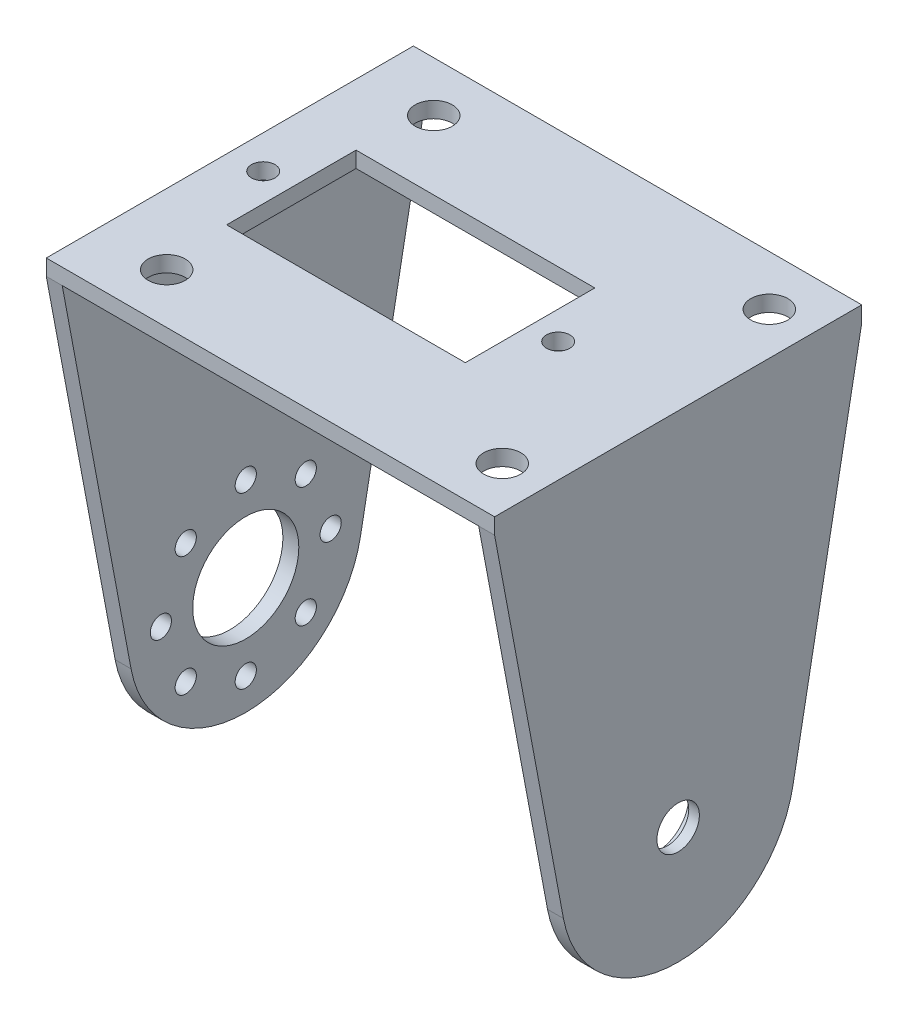
ISO-10303-21;
HEADER;
FILE_DESCRIPTION(('STEP AP214'),'2;1');
FILE_NAME('part.step','',(''),(''),'','','');
FILE_SCHEMA(('AUTOMOTIVE_DESIGN { 1 0 10303 214 1 1 1 1 }'));
ENDSEC;
DATA;
#1=APPLICATION_CONTEXT('core data for automotive mechanical design processes');
#2=APPLICATION_PROTOCOL_DEFINITION('international standard','automotive_design',2000,#1);
#3=PRODUCT_CONTEXT('',#1,'mechanical');
#4=PRODUCT('Part','Part','',(#3));
#5=PRODUCT_RELATED_PRODUCT_CATEGORY('part','',(#4));
#6=PRODUCT_DEFINITION_FORMATION('','',#4);
#7=PRODUCT_DEFINITION_CONTEXT('part definition',#1,'design');
#8=PRODUCT_DEFINITION('design','',#6,#7);
#9=PRODUCT_DEFINITION_SHAPE('','',#8);
#10=(LENGTH_UNIT() NAMED_UNIT(*) SI_UNIT(.MILLI.,.METRE.));
#11=(NAMED_UNIT(*) PLANE_ANGLE_UNIT() SI_UNIT($,.RADIAN.));
#12=(NAMED_UNIT(*) SI_UNIT($,.STERADIAN.) SOLID_ANGLE_UNIT());
#13=UNCERTAINTY_MEASURE_WITH_UNIT(LENGTH_MEASURE(1.E-05),#10,'distance_accuracy_value','');
#14=(GEOMETRIC_REPRESENTATION_CONTEXT(3) GLOBAL_UNCERTAINTY_ASSIGNED_CONTEXT((#13)) GLOBAL_UNIT_ASSIGNED_CONTEXT((#10,
#11,#12)) REPRESENTATION_CONTEXT('',''));
#15=CARTESIAN_POINT('',(0.,0.,0.));
#16=DIRECTION('',(0.,0.,1.));
#17=DIRECTION('',(1.,0.,0.));
#18=AXIS2_PLACEMENT_3D('',#15,#16,#17);
#19=CARTESIAN_POINT('',(42.25,0.,0.));
#20=DIRECTION('',(-1.,0.,0.));
#21=DIRECTION('',(0.,0.,1.));
#22=AXIS2_PLACEMENT_3D('',#19,#20,#21);
#23=CYLINDRICAL_SURFACE('',#22,3.);
#24=CARTESIAN_POINT('',(40.25,0.,0.));
#25=DIRECTION('',(1.,0.,0.));
#26=DIRECTION('',(0.,0.,-1.));
#27=AXIS2_PLACEMENT_3D('',#24,#25,#26);
#28=CIRCLE('',#27,3.);
#29=CARTESIAN_POINT('',(40.25,0.,-3.));
#30=VERTEX_POINT('',#29);
#31=EDGE_CURVE('E596',#30,#30,#28,.T.);
#32=ORIENTED_EDGE('',*,*,#31,.F.);
#33=EDGE_LOOP('',(#32));
#34=FACE_BOUND('',#33,.T.);
#35=CARTESIAN_POINT('',(41.25,0.,0.));
#36=DIRECTION('',(1.,0.,0.));
#37=DIRECTION('',(0.,0.,-1.));
#38=AXIS2_PLACEMENT_3D('',#35,#36,#37);
#39=CIRCLE('',#38,3.);
#40=CARTESIAN_POINT('',(41.25,0.,-3.));
#41=VERTEX_POINT('',#40);
#42=EDGE_CURVE('E590',#41,#41,#39,.T.);
#43=ORIENTED_EDGE('',*,*,#42,.T.);
#44=EDGE_LOOP('',(#43));
#45=FACE_BOUND('',#44,.T.);
#46=ADVANCED_FACE('F74',(#34,#45),#23,.F.);
#47=CARTESIAN_POINT('',(1.5,0.,0.));
#48=DIRECTION('',(1.,0.,0.));
#49=DIRECTION('',(0.,0.,-1.));
#50=AXIS2_PLACEMENT_3D('',#47,#48,#49);
#51=PLANE('',#50);
#52=CARTESIAN_POINT('',(1.5,5.65685424949245,5.65685424949231));
#53=DIRECTION('',(1.,0.,0.));
#54=DIRECTION('',(0.,0.,-1.));
#55=AXIS2_PLACEMENT_3D('',#52,#53,#54);
#56=CIRCLE('',#55,1.);
#57=CARTESIAN_POINT('',(1.5,5.65685424949245,4.65685424949231));
#58=VERTEX_POINT('',#57);
#59=EDGE_CURVE('E289',#58,#58,#56,.T.);
#60=ORIENTED_EDGE('',*,*,#59,.F.);
#61=EDGE_LOOP('',(#60));
#62=FACE_BOUND('',#61,.T.);
#63=CARTESIAN_POINT('',(1.5,0.,8.));
#64=DIRECTION('',(1.,0.,0.));
#65=DIRECTION('',(0.,0.,-1.));
#66=AXIS2_PLACEMENT_3D('',#63,#64,#65);
#67=CIRCLE('',#66,1.00000000000008);
#68=CARTESIAN_POINT('',(1.5,0.,6.99999999999992));
#69=VERTEX_POINT('',#68);
#70=EDGE_CURVE('E293',#69,#69,#67,.T.);
#71=ORIENTED_EDGE('',*,*,#70,.F.);
#72=EDGE_LOOP('',(#71));
#73=FACE_BOUND('',#72,.T.);
#74=CARTESIAN_POINT('',(1.5,-5.65685424949233,5.65685424949243));
#75=DIRECTION('',(1.,0.,0.));
#76=DIRECTION('',(0.,0.,-1.));
#77=AXIS2_PLACEMENT_3D('',#74,#75,#76);
#78=CIRCLE('',#77,1.);
#79=CARTESIAN_POINT('',(1.5,-5.65685424949233,4.65685424949243));
#80=VERTEX_POINT('',#79);
#81=EDGE_CURVE('E297',#80,#80,#78,.T.);
#82=ORIENTED_EDGE('',*,*,#81,.F.);
#83=EDGE_LOOP('',(#82));
#84=FACE_BOUND('',#83,.T.);
#85=CARTESIAN_POINT('',(1.5,-8.,0.));
#86=DIRECTION('',(1.,0.,0.));
#87=DIRECTION('',(0.,0.,-1.));
#88=AXIS2_PLACEMENT_3D('',#85,#86,#87);
#89=CIRCLE('',#88,1.);
#90=CARTESIAN_POINT('',(1.5,-8.,-0.999999999999944));
#91=VERTEX_POINT('',#90);
#92=EDGE_CURVE('E301',#91,#91,#89,.T.);
#93=ORIENTED_EDGE('',*,*,#92,.F.);
#94=EDGE_LOOP('',(#93));
#95=FACE_BOUND('',#94,.T.);
#96=CARTESIAN_POINT('',(1.5,-5.65685424949241,-5.65685424949235));
#97=DIRECTION('',(1.,0.,0.));
#98=DIRECTION('',(0.,0.,-1.));
#99=AXIS2_PLACEMENT_3D('',#96,#97,#98);
#100=CIRCLE('',#99,1.);
#101=CARTESIAN_POINT('',(1.5,-5.65685424949241,-6.65685424949235));
#102=VERTEX_POINT('',#101);
#103=EDGE_CURVE('E305',#102,#102,#100,.T.);
#104=ORIENTED_EDGE('',*,*,#103,.F.);
#105=EDGE_LOOP('',(#104));
#106=FACE_BOUND('',#105,.T.);
#107=CARTESIAN_POINT('',(1.5,0.,-8.));
#108=DIRECTION('',(1.,0.,0.));
#109=DIRECTION('',(0.,0.,-1.));
#110=AXIS2_PLACEMENT_3D('',#107,#108,#109);
#111=CIRCLE('',#110,1.);
#112=CARTESIAN_POINT('',(1.5,0.,-9.));
#113=VERTEX_POINT('',#112);
#114=EDGE_CURVE('E309',#113,#113,#111,.T.);
#115=ORIENTED_EDGE('',*,*,#114,.F.);
#116=EDGE_LOOP('',(#115));
#117=FACE_BOUND('',#116,.T.);
#118=CARTESIAN_POINT('',(1.5,5.65685424949237,-5.65685424949239));
#119=DIRECTION('',(1.,0.,0.));
#120=DIRECTION('',(0.,0.,-1.));
#121=AXIS2_PLACEMENT_3D('',#118,#119,#120);
#122=CIRCLE('',#121,1.);
#123=CARTESIAN_POINT('',(1.5,5.65685424949237,-6.65685424949239));
#124=VERTEX_POINT('',#123);
#125=EDGE_CURVE('E313',#124,#124,#122,.T.);
#126=ORIENTED_EDGE('',*,*,#125,.F.);
#127=EDGE_LOOP('',(#126));
#128=FACE_BOUND('',#127,.T.);
#129=CARTESIAN_POINT('',(1.5,8.,0.));
#130=DIRECTION('',(1.,0.,0.));
#131=DIRECTION('',(0.,0.,-1.));
#132=AXIS2_PLACEMENT_3D('',#129,#130,#131);
#133=CIRCLE('',#132,1.);
#134=CARTESIAN_POINT('',(1.5,8.,-1.));
#135=VERTEX_POINT('',#134);
#136=EDGE_CURVE('E317',#135,#135,#133,.T.);
#137=ORIENTED_EDGE('',*,*,#136,.F.);
#138=EDGE_LOOP('',(#137));
#139=FACE_BOUND('',#138,.T.);
#140=CARTESIAN_POINT('',(1.5,0.,0.));
#141=DIRECTION('',(1.,0.,0.));
#142=DIRECTION('',(0.,0.,-1.));
#143=AXIS2_PLACEMENT_3D('',#140,#141,#142);
#144=CIRCLE('',#143,5.);
#145=CARTESIAN_POINT('',(1.5,0.,-5.));
#146=VERTEX_POINT('',#145);
#147=EDGE_CURVE('E321',#146,#146,#144,.T.);
#148=ORIENTED_EDGE('',*,*,#147,.F.);
#149=EDGE_LOOP('',(#148));
#150=FACE_BOUND('',#149,.T.);
#151=DIRECTION('',(0.,-0.982797037035179,0.184688884329495));
#152=VECTOR('',#151,1.);
#153=CARTESIAN_POINT('',(1.5,-2.03157772762444,-10.810767407387));
#154=LINE('',#153,#152);
#155=CARTESIAN_POINT('',(1.5,32.5,-17.3));
#156=VERTEX_POINT('',#155);
#157=CARTESIAN_POINT('',(1.5,-2.03157772762444,-10.810767407387));
#158=VERTEX_POINT('',#157);
#159=EDGE_CURVE('E285',#156,#158,#154,.T.);
#160=ORIENTED_EDGE('',*,*,#159,.F.);
#161=DIRECTION('',(0.,0.,1.));
#162=VECTOR('',#161,1.);
#163=CARTESIAN_POINT('',(1.5,32.5,0.));
#164=LINE('',#163,#162);
#165=CARTESIAN_POINT('',(1.5,32.5,17.3));
#166=VERTEX_POINT('',#165);
#167=EDGE_CURVE('E272',#156,#166,#164,.T.);
#168=ORIENTED_EDGE('',*,*,#167,.T.);
#169=DIRECTION('',(0.,-0.982797037035179,-0.184688884329495));
#170=VECTOR('',#169,1.);
#171=CARTESIAN_POINT('',(1.5,-2.03157772762445,10.810767407387));
#172=LINE('',#171,#170);
#173=CARTESIAN_POINT('',(1.5,-2.03157772762445,10.810767407387));
#174=VERTEX_POINT('',#173);
#175=EDGE_CURVE('E277',#166,#174,#172,.T.);
#176=ORIENTED_EDGE('',*,*,#175,.T.);
#177=CARTESIAN_POINT('',(1.5,0.,0.));
#178=DIRECTION('',(1.,0.,0.));
#179=DIRECTION('',(0.,0.,-1.));
#180=AXIS2_PLACEMENT_3D('',#177,#178,#179);
#181=CIRCLE('',#180,11.);
#182=EDGE_CURVE('E281',#174,#158,#181,.T.);
#183=ORIENTED_EDGE('',*,*,#182,.T.);
#184=EDGE_LOOP('',(#160,#168,#176,#183));
#185=FACE_BOUND('',#184,.T.);
#186=ADVANCED_FACE('F455',(#62,#73,#84,#95,#106,#117,#128,#139,#150,#185),#51,.T.);
#187=CARTESIAN_POINT('',(1.5,-2.03157772762445,10.810767407387));
#188=DIRECTION('',(0.,0.184688884329495,-0.982797037035179));
#189=DIRECTION('',(0.,0.982797037035179,0.184688884329495));
#190=AXIS2_PLACEMENT_3D('',#187,#188,#189);
#191=PLANE('',#190);
#192=DIRECTION('',(0.,-0.982797037035179,-0.184688884329495));
#193=VECTOR('',#192,1.);
#194=CARTESIAN_POINT('',(0.,-2.03157772762445,10.810767407387));
#195=LINE('',#194,#193);
#196=CARTESIAN_POINT('',(0.,32.5,17.3));
#197=VERTEX_POINT('',#196);
#198=CARTESIAN_POINT('',(0.,-2.03157772762445,10.810767407387));
#199=VERTEX_POINT('',#198);
#200=EDGE_CURVE('E276',#197,#199,#195,.T.);
#201=ORIENTED_EDGE('',*,*,#200,.T.);
#202=DIRECTION('',(-1.,0.,0.));
#203=VECTOR('',#202,1.);
#204=CARTESIAN_POINT('',(1.5,-2.03157772762445,10.810767407387));
#205=LINE('',#204,#203);
#206=EDGE_CURVE('E398',#174,#199,#205,.T.);
#207=ORIENTED_EDGE('',*,*,#206,.F.);
#208=ORIENTED_EDGE('',*,*,#175,.F.);
#209=DIRECTION('',(-1.,0.,0.));
#210=VECTOR('',#209,1.);
#211=CARTESIAN_POINT('',(1.5,32.5,17.3));
#212=LINE('',#211,#210);
#213=EDGE_CURVE('E325',#166,#197,#212,.T.);
#214=ORIENTED_EDGE('',*,*,#213,.T.);
#215=EDGE_LOOP('',(#201,#207,#208,#214));
#216=FACE_BOUND('',#215,.T.);
#217=ADVANCED_FACE('F76',(#216),#191,.F.);
#218=CARTESIAN_POINT('',(1.5,0.,0.));
#219=DIRECTION('',(-1.,0.,0.));
#220=DIRECTION('',(0.,0.,1.));
#221=AXIS2_PLACEMENT_3D('',#218,#219,#220);
#222=CYLINDRICAL_SURFACE('',#221,11.);
#223=CARTESIAN_POINT('',(0.,0.,0.));
#224=DIRECTION('',(1.,0.,0.));
#225=DIRECTION('',(0.,0.,-1.));
#226=AXIS2_PLACEMENT_3D('',#223,#224,#225);
#227=CIRCLE('',#226,11.);
#228=CARTESIAN_POINT('',(0.,-2.03157772762444,-10.810767407387));
#229=VERTEX_POINT('',#228);
#230=EDGE_CURVE('E329',#199,#229,#227,.T.);
#231=ORIENTED_EDGE('',*,*,#230,.T.);
#232=DIRECTION('',(-1.,0.,0.));
#233=VECTOR('',#232,1.);
#234=CARTESIAN_POINT('',(1.5,-2.03157772762444,-10.810767407387));
#235=LINE('',#234,#233);
#236=EDGE_CURVE('E395',#158,#229,#235,.T.);
#237=ORIENTED_EDGE('',*,*,#236,.F.);
#238=ORIENTED_EDGE('',*,*,#182,.F.);
#239=ORIENTED_EDGE('',*,*,#206,.T.);
#240=EDGE_LOOP('',(#231,#237,#238,#239));
#241=FACE_BOUND('',#240,.T.);
#242=ADVANCED_FACE('F544',(#241),#222,.T.);
#243=CARTESIAN_POINT('',(1.5,-2.03157772762444,-10.810767407387));
#244=DIRECTION('',(0.,-0.184688884329495,-0.982797037035179));
#245=DIRECTION('',(0.,0.982797037035179,-0.184688884329495));
#246=AXIS2_PLACEMENT_3D('',#243,#244,#245);
#247=PLANE('',#246);
#248=DIRECTION('',(0.,-0.982797037035179,0.184688884329495));
#249=VECTOR('',#248,1.);
#250=CARTESIAN_POINT('',(0.,-2.03157772762444,-10.810767407387));
#251=LINE('',#250,#249);
#252=CARTESIAN_POINT('',(0.,32.5,-17.3));
#253=VERTEX_POINT('',#252);
#254=EDGE_CURVE('E333',#253,#229,#251,.T.);
#255=ORIENTED_EDGE('',*,*,#254,.F.);
#256=DIRECTION('',(-1.,0.,0.));
#257=VECTOR('',#256,1.);
#258=CARTESIAN_POINT('',(1.5,32.5,-17.3));
#259=LINE('',#258,#257);
#260=EDGE_CURVE('E392',#156,#253,#259,.T.);
#261=ORIENTED_EDGE('',*,*,#260,.F.);
#262=ORIENTED_EDGE('',*,*,#159,.T.);
#263=ORIENTED_EDGE('',*,*,#236,.T.);
#264=EDGE_LOOP('',(#255,#261,#262,#263));
#265=FACE_BOUND('',#264,.T.);
#266=ADVANCED_FACE('F541',(#265),#247,.T.);
#267=CARTESIAN_POINT('',(1.5,0.,-17.3));
#268=DIRECTION('',(0.,0.,1.));
#269=DIRECTION('',(1.,0.,0.));
#270=AXIS2_PLACEMENT_3D('',#267,#268,#269);
#271=PLANE('',#270);
#272=DIRECTION('',(0.,1.,0.));
#273=VECTOR('',#272,1.);
#274=CARTESIAN_POINT('',(0.,0.,-17.3));
#275=LINE('',#274,#273);
#276=CARTESIAN_POINT('',(0.,34.,-17.3));
#277=VERTEX_POINT('',#276);
#278=EDGE_CURVE('E337',#253,#277,#275,.T.);
#279=ORIENTED_EDGE('',*,*,#278,.T.);
#280=DIRECTION('',(-1.,0.,0.));
#281=VECTOR('',#280,1.);
#282=CARTESIAN_POINT('',(1.5,34.,-17.3));
#283=LINE('',#282,#281);
#284=CARTESIAN_POINT('',(42.25,34.,-17.3));
#285=VERTEX_POINT('',#284);
#286=EDGE_CURVE('E389',#285,#277,#283,.T.);
#287=ORIENTED_EDGE('',*,*,#286,.F.);
#288=DIRECTION('',(0.,-1.,0.));
#289=VECTOR('',#288,1.);
#290=CARTESIAN_POINT('',(42.25,0.,-17.3));
#291=LINE('',#290,#289);
#292=CARTESIAN_POINT('',(42.25,32.5,-17.3));
#293=VERTEX_POINT('',#292);
#294=EDGE_CURVE('E232',#285,#293,#291,.T.);
#295=ORIENTED_EDGE('',*,*,#294,.T.);
#296=DIRECTION('',(-1.,0.,0.));
#297=VECTOR('',#296,1.);
#298=CARTESIAN_POINT('',(42.25,32.5,-17.3));
#299=LINE('',#298,#297);
#300=CARTESIAN_POINT('',(40.75,32.5,-17.3));
#301=VERTEX_POINT('',#300);
#302=EDGE_CURVE('E236',#293,#301,#299,.T.);
#303=ORIENTED_EDGE('',*,*,#302,.T.);
#304=DIRECTION('',(-1.,0.,0.));
#305=VECTOR('',#304,1.);
#306=CARTESIAN_POINT('',(40.75,32.5,-17.3));
#307=LINE('',#306,#305);
#308=EDGE_CURVE('E268',#301,#156,#307,.T.);
#309=ORIENTED_EDGE('',*,*,#308,.T.);
#310=ORIENTED_EDGE('',*,*,#260,.T.);
#311=EDGE_LOOP('',(#279,#287,#295,#303,#309,#310));
#312=FACE_BOUND('',#311,.T.);
#313=ADVANCED_FACE('F537',(#312),#271,.F.);
#314=CARTESIAN_POINT('',(1.5,34.,0.));
#315=DIRECTION('',(0.,1.,0.));
#316=DIRECTION('',(0.,0.,1.));
#317=AXIS2_PLACEMENT_3D('',#314,#315,#316);
#318=PLANE('',#317);
#319=CARTESIAN_POINT('',(6.63,34.,12.583801515));
#320=DIRECTION('',(0.,1.,0.));
#321=DIRECTION('',(0.,0.,1.));
#322=AXIS2_PLACEMENT_3D('',#319,#320,#321);
#323=CIRCLE('',#322,1.75);
#324=CARTESIAN_POINT('',(6.63,34.,14.333801515));
#325=VERTEX_POINT('',#324);
#326=EDGE_CURVE('E605',#325,#325,#323,.T.);
#327=ORIENTED_EDGE('',*,*,#326,.F.);
#328=EDGE_LOOP('',(#327));
#329=FACE_BOUND('',#328,.T.);
#330=CARTESIAN_POINT('',(38.257478,34.,12.583801515));
#331=DIRECTION('',(0.,1.,0.));
#332=DIRECTION('',(0.,0.,1.));
#333=AXIS2_PLACEMENT_3D('',#330,#331,#332);
#334=CIRCLE('',#333,1.75);
#335=CARTESIAN_POINT('',(38.257478,34.,14.333801515));
#336=VERTEX_POINT('',#335);
#337=EDGE_CURVE('E625',#336,#336,#334,.T.);
#338=ORIENTED_EDGE('',*,*,#337,.F.);
#339=EDGE_LOOP('',(#338));
#340=FACE_BOUND('',#339,.T.);
#341=CARTESIAN_POINT('',(38.257478,34.,-12.583801515));
#342=DIRECTION('',(0.,1.,0.));
#343=DIRECTION('',(0.,0.,1.));
#344=AXIS2_PLACEMENT_3D('',#341,#342,#343);
#345=CIRCLE('',#344,1.75);
#346=CARTESIAN_POINT('',(38.257478,34.,-10.833801515));
#347=VERTEX_POINT('',#346);
#348=EDGE_CURVE('E621',#347,#347,#345,.T.);
#349=ORIENTED_EDGE('',*,*,#348,.F.);
#350=EDGE_LOOP('',(#349));
#351=FACE_BOUND('',#350,.T.);
#352=CARTESIAN_POINT('',(6.63,34.,-12.583801515));
#353=DIRECTION('',(0.,1.,0.));
#354=DIRECTION('',(0.,0.,1.));
#355=AXIS2_PLACEMENT_3D('',#352,#353,#354);
#356=CIRCLE('',#355,1.75);
#357=CARTESIAN_POINT('',(6.63,34.,-10.833801515));
#358=VERTEX_POINT('',#357);
#359=EDGE_CURVE('E617',#358,#358,#356,.T.);
#360=ORIENTED_EDGE('',*,*,#359,.F.);
#361=EDGE_LOOP('',(#360));
#362=FACE_BOUND('',#361,.T.);
#363=CARTESIAN_POINT('',(3.145,34.,0.));
#364=DIRECTION('',(0.,1.,0.));
#365=DIRECTION('',(0.,0.,1.));
#366=AXIS2_PLACEMENT_3D('',#363,#364,#365);
#367=CIRCLE('',#366,1.1);
#368=CARTESIAN_POINT('',(3.145,34.,1.1));
#369=VERTEX_POINT('',#368);
#370=EDGE_CURVE('E613',#369,#369,#367,.T.);
#371=ORIENTED_EDGE('',*,*,#370,.F.);
#372=EDGE_LOOP('',(#371));
#373=FACE_BOUND('',#372,.T.);
#374=CARTESIAN_POINT('',(30.945,34.,0.));
#375=DIRECTION('',(0.,1.,0.));
#376=DIRECTION('',(0.,0.,1.));
#377=AXIS2_PLACEMENT_3D('',#374,#375,#376);
#378=CIRCLE('',#377,1.10000000000001);
#379=CARTESIAN_POINT('',(30.945,34.,1.10000000000001));
#380=VERTEX_POINT('',#379);
#381=EDGE_CURVE('E609',#380,#380,#378,.T.);
#382=ORIENTED_EDGE('',*,*,#381,.F.);
#383=EDGE_LOOP('',(#382));
#384=FACE_BOUND('',#383,.T.);
#385=DIRECTION('',(0.,0.,-1.));
#386=VECTOR('',#385,1.);
#387=CARTESIAN_POINT('',(28.295,34.,6.1));
#388=LINE('',#387,#386);
#389=CARTESIAN_POINT('',(28.295,34.,6.1));
#390=VERTEX_POINT('',#389);
#391=CARTESIAN_POINT('',(28.295,34.,-6.1));
#392=VERTEX_POINT('',#391);
#393=EDGE_CURVE('E92',#390,#392,#388,.T.);
#394=ORIENTED_EDGE('',*,*,#393,.F.);
#395=DIRECTION('',(1.,0.,0.));
#396=VECTOR('',#395,1.);
#397=CARTESIAN_POINT('',(5.795,34.,6.1));
#398=LINE('',#397,#396);
#399=CARTESIAN_POINT('',(5.795,34.,6.1));
#400=VERTEX_POINT('',#399);
#401=EDGE_CURVE('E199',#400,#390,#398,.T.);
#402=ORIENTED_EDGE('',*,*,#401,.F.);
#403=DIRECTION('',(0.,0.,1.));
#404=VECTOR('',#403,1.);
#405=CARTESIAN_POINT('',(5.795,34.,6.1));
#406=LINE('',#405,#404);
#407=CARTESIAN_POINT('',(5.795,34.,-6.1));
#408=VERTEX_POINT('',#407);
#409=EDGE_CURVE('E181',#408,#400,#406,.T.);
#410=ORIENTED_EDGE('',*,*,#409,.F.);
#411=DIRECTION('',(-1.,0.,0.));
#412=VECTOR('',#411,1.);
#413=CARTESIAN_POINT('',(5.795,34.,-6.1));
#414=LINE('',#413,#412);
#415=EDGE_CURVE('E191',#392,#408,#414,.T.);
#416=ORIENTED_EDGE('',*,*,#415,.F.);
#417=EDGE_LOOP('',(#394,#402,#410,#416));
#418=FACE_BOUND('',#417,.T.);
#419=DIRECTION('',(0.,0.,-1.));
#420=VECTOR('',#419,1.);
#421=CARTESIAN_POINT('',(0.,34.,0.));
#422=LINE('',#421,#420);
#423=CARTESIAN_POINT('',(0.,34.,17.3));
#424=VERTEX_POINT('',#423);
#425=EDGE_CURVE('E341',#424,#277,#422,.T.);
#426=ORIENTED_EDGE('',*,*,#425,.F.);
#427=DIRECTION('',(-1.,0.,0.));
#428=VECTOR('',#427,1.);
#429=CARTESIAN_POINT('',(1.5,34.,17.3));
#430=LINE('',#429,#428);
#431=CARTESIAN_POINT('',(42.25,34.,17.3));
#432=VERTEX_POINT('',#431);
#433=EDGE_CURVE('E386',#432,#424,#430,.T.);
#434=ORIENTED_EDGE('',*,*,#433,.F.);
#435=DIRECTION('',(0.,0.,1.));
#436=VECTOR('',#435,1.);
#437=CARTESIAN_POINT('',(42.25,34.,0.));
#438=LINE('',#437,#436);
#439=EDGE_CURVE('E214',#285,#432,#438,.T.);
#440=ORIENTED_EDGE('',*,*,#439,.F.);
#441=ORIENTED_EDGE('',*,*,#286,.T.);
#442=EDGE_LOOP('',(#426,#434,#440,#441));
#443=FACE_BOUND('',#442,.T.);
#444=ADVANCED_FACE('F196',(#329,#340,#351,#362,#373,#384,#418,#443),#318,.T.);
#445=CARTESIAN_POINT('',(1.5,8.,0.));
#446=DIRECTION('',(-1.,0.,0.));
#447=DIRECTION('',(0.,0.,1.));
#448=AXIS2_PLACEMENT_3D('',#445,#446,#447);
#449=CYLINDRICAL_SURFACE('',#448,1.);
#450=ORIENTED_EDGE('',*,*,#136,.T.);
#451=EDGE_LOOP('',(#450));
#452=FACE_BOUND('',#451,.T.);
#453=CARTESIAN_POINT('',(0.,8.,0.));
#454=DIRECTION('',(1.,0.,0.));
#455=DIRECTION('',(0.,0.,-1.));
#456=AXIS2_PLACEMENT_3D('',#453,#454,#455);
#457=CIRCLE('',#456,1.);
#458=CARTESIAN_POINT('',(0.,8.,-1.));
#459=VERTEX_POINT('',#458);
#460=EDGE_CURVE('E377',#459,#459,#457,.T.);
#461=ORIENTED_EDGE('',*,*,#460,.F.);
#462=EDGE_LOOP('',(#461));
#463=FACE_BOUND('',#462,.T.);
#464=ADVANCED_FACE('F500',(#452,#463),#449,.F.);
#465=CARTESIAN_POINT('',(1.5,5.65685424949237,-5.65685424949239));
#466=DIRECTION('',(-1.,0.,0.));
#467=DIRECTION('',(0.,0.,1.));
#468=AXIS2_PLACEMENT_3D('',#465,#466,#467);
#469=CYLINDRICAL_SURFACE('',#468,1.);
#470=ORIENTED_EDGE('',*,*,#125,.T.);
#471=EDGE_LOOP('',(#470));
#472=FACE_BOUND('',#471,.T.);
#473=CARTESIAN_POINT('',(0.,5.65685424949237,-5.65685424949239));
#474=DIRECTION('',(1.,0.,0.));
#475=DIRECTION('',(0.,0.,-1.));
#476=AXIS2_PLACEMENT_3D('',#473,#474,#475);
#477=CIRCLE('',#476,1.);
#478=CARTESIAN_POINT('',(0.,5.65685424949237,-6.65685424949239));
#479=VERTEX_POINT('',#478);
#480=EDGE_CURVE('E373',#479,#479,#477,.T.);
#481=ORIENTED_EDGE('',*,*,#480,.F.);
#482=EDGE_LOOP('',(#481));
#483=FACE_BOUND('',#482,.T.);
#484=ADVANCED_FACE('F503',(#472,#483),#469,.F.);
#485=CARTESIAN_POINT('',(1.5,0.,-8.));
#486=DIRECTION('',(-1.,0.,0.));
#487=DIRECTION('',(0.,0.,1.));
#488=AXIS2_PLACEMENT_3D('',#485,#486,#487);
#489=CYLINDRICAL_SURFACE('',#488,1.);
#490=ORIENTED_EDGE('',*,*,#114,.T.);
#491=EDGE_LOOP('',(#490));
#492=FACE_BOUND('',#491,.T.);
#493=CARTESIAN_POINT('',(0.,0.,-8.));
#494=DIRECTION('',(1.,0.,0.));
#495=DIRECTION('',(0.,0.,-1.));
#496=AXIS2_PLACEMENT_3D('',#493,#494,#495);
#497=CIRCLE('',#496,1.);
#498=CARTESIAN_POINT('',(0.,0.,-9.));
#499=VERTEX_POINT('',#498);
#500=EDGE_CURVE('E369',#499,#499,#497,.T.);
#501=ORIENTED_EDGE('',*,*,#500,.F.);
#502=EDGE_LOOP('',(#501));
#503=FACE_BOUND('',#502,.T.);
#504=ADVANCED_FACE('F507',(#492,#503),#489,.F.);
#505=CARTESIAN_POINT('',(1.5,-5.65685424949241,-5.65685424949235));
#506=DIRECTION('',(-1.,0.,0.));
#507=DIRECTION('',(0.,0.,1.));
#508=AXIS2_PLACEMENT_3D('',#505,#506,#507);
#509=CYLINDRICAL_SURFACE('',#508,1.);
#510=ORIENTED_EDGE('',*,*,#103,.T.);
#511=EDGE_LOOP('',(#510));
#512=FACE_BOUND('',#511,.T.);
#513=CARTESIAN_POINT('',(0.,-5.65685424949241,-5.65685424949235));
#514=DIRECTION('',(1.,0.,0.));
#515=DIRECTION('',(0.,0.,-1.));
#516=AXIS2_PLACEMENT_3D('',#513,#514,#515);
#517=CIRCLE('',#516,1.);
#518=CARTESIAN_POINT('',(0.,-5.65685424949241,-6.65685424949235));
#519=VERTEX_POINT('',#518);
#520=EDGE_CURVE('E365',#519,#519,#517,.T.);
#521=ORIENTED_EDGE('',*,*,#520,.F.);
#522=EDGE_LOOP('',(#521));
#523=FACE_BOUND('',#522,.T.);
#524=ADVANCED_FACE('F511',(#512,#523),#509,.F.);
#525=CARTESIAN_POINT('',(1.5,-8.,0.));
#526=DIRECTION('',(-1.,0.,0.));
#527=DIRECTION('',(0.,0.,1.));
#528=AXIS2_PLACEMENT_3D('',#525,#526,#527);
#529=CYLINDRICAL_SURFACE('',#528,1.);
#530=ORIENTED_EDGE('',*,*,#92,.T.);
#531=EDGE_LOOP('',(#530));
#532=FACE_BOUND('',#531,.T.);
#533=CARTESIAN_POINT('',(0.,-8.,0.));
#534=DIRECTION('',(1.,0.,0.));
#535=DIRECTION('',(0.,0.,-1.));
#536=AXIS2_PLACEMENT_3D('',#533,#534,#535);
#537=CIRCLE('',#536,1.);
#538=CARTESIAN_POINT('',(0.,-8.,-0.999999999999944));
#539=VERTEX_POINT('',#538);
#540=EDGE_CURVE('E361',#539,#539,#537,.T.);
#541=ORIENTED_EDGE('',*,*,#540,.F.);
#542=EDGE_LOOP('',(#541));
#543=FACE_BOUND('',#542,.T.);
#544=ADVANCED_FACE('F515',(#532,#543),#529,.F.);
#545=CARTESIAN_POINT('',(1.5,-5.65685424949233,5.65685424949243));
#546=DIRECTION('',(-1.,0.,0.));
#547=DIRECTION('',(0.,0.,1.));
#548=AXIS2_PLACEMENT_3D('',#545,#546,#547);
#549=CYLINDRICAL_SURFACE('',#548,1.);
#550=ORIENTED_EDGE('',*,*,#81,.T.);
#551=EDGE_LOOP('',(#550));
#552=FACE_BOUND('',#551,.T.);
#553=CARTESIAN_POINT('',(0.,-5.65685424949233,5.65685424949243));
#554=DIRECTION('',(1.,0.,0.));
#555=DIRECTION('',(0.,0.,-1.));
#556=AXIS2_PLACEMENT_3D('',#553,#554,#555);
#557=CIRCLE('',#556,1.);
#558=CARTESIAN_POINT('',(0.,-5.65685424949233,4.65685424949243));
#559=VERTEX_POINT('',#558);
#560=EDGE_CURVE('E357',#559,#559,#557,.T.);
#561=ORIENTED_EDGE('',*,*,#560,.F.);
#562=EDGE_LOOP('',(#561));
#563=FACE_BOUND('',#562,.T.);
#564=ADVANCED_FACE('F519',(#552,#563),#549,.F.);
#565=CARTESIAN_POINT('',(1.5,0.,8.));
#566=DIRECTION('',(-1.,0.,0.));
#567=DIRECTION('',(0.,0.,1.));
#568=AXIS2_PLACEMENT_3D('',#565,#566,#567);
#569=CYLINDRICAL_SURFACE('',#568,1.00000000000008);
#570=ORIENTED_EDGE('',*,*,#70,.T.);
#571=EDGE_LOOP('',(#570));
#572=FACE_BOUND('',#571,.T.);
#573=CARTESIAN_POINT('',(0.,0.,8.));
#574=DIRECTION('',(1.,0.,0.));
#575=DIRECTION('',(0.,0.,-1.));
#576=AXIS2_PLACEMENT_3D('',#573,#574,#575);
#577=CIRCLE('',#576,1.00000000000008);
#578=CARTESIAN_POINT('',(0.,0.,6.99999999999992));
#579=VERTEX_POINT('',#578);
#580=EDGE_CURVE('E353',#579,#579,#577,.T.);
#581=ORIENTED_EDGE('',*,*,#580,.F.);
#582=EDGE_LOOP('',(#581));
#583=FACE_BOUND('',#582,.T.);
#584=ADVANCED_FACE('F523',(#572,#583),#569,.F.);
#585=CARTESIAN_POINT('',(1.5,5.65685424949245,5.65685424949231));
#586=DIRECTION('',(-1.,0.,0.));
#587=DIRECTION('',(0.,0.,1.));
#588=AXIS2_PLACEMENT_3D('',#585,#586,#587);
#589=CYLINDRICAL_SURFACE('',#588,1.);
#590=ORIENTED_EDGE('',*,*,#59,.T.);
#591=EDGE_LOOP('',(#590));
#592=FACE_BOUND('',#591,.T.);
#593=CARTESIAN_POINT('',(0.,5.65685424949245,5.65685424949231));
#594=DIRECTION('',(1.,0.,0.));
#595=DIRECTION('',(0.,0.,-1.));
#596=AXIS2_PLACEMENT_3D('',#593,#594,#595);
#597=CIRCLE('',#596,1.);
#598=CARTESIAN_POINT('',(0.,5.65685424949245,4.65685424949231));
#599=VERTEX_POINT('',#598);
#600=EDGE_CURVE('E349',#599,#599,#597,.T.);
#601=ORIENTED_EDGE('',*,*,#600,.F.);
#602=EDGE_LOOP('',(#601));
#603=FACE_BOUND('',#602,.T.);
#604=ADVANCED_FACE('F527',(#592,#603),#589,.F.);
#605=CARTESIAN_POINT('',(1.5,0.,17.3));
#606=DIRECTION('',(0.,0.,1.));
#607=DIRECTION('',(1.,0.,0.));
#608=AXIS2_PLACEMENT_3D('',#605,#606,#607);
#609=PLANE('',#608);
#610=DIRECTION('',(0.,1.,0.));
#611=VECTOR('',#610,1.);
#612=CARTESIAN_POINT('',(0.,0.,17.3));
#613=LINE('',#612,#611);
#614=EDGE_CURVE('E345',#197,#424,#613,.T.);
#615=ORIENTED_EDGE('',*,*,#614,.F.);
#616=ORIENTED_EDGE('',*,*,#213,.F.);
#617=DIRECTION('',(-1.,0.,0.));
#618=VECTOR('',#617,1.);
#619=CARTESIAN_POINT('',(40.75,32.5,17.3));
#620=LINE('',#619,#618);
#621=CARTESIAN_POINT('',(40.75,32.5,17.3));
#622=VERTEX_POINT('',#621);
#623=EDGE_CURVE('E265',#622,#166,#620,.T.);
#624=ORIENTED_EDGE('',*,*,#623,.F.);
#625=DIRECTION('',(-1.,0.,0.));
#626=VECTOR('',#625,1.);
#627=CARTESIAN_POINT('',(42.25,32.5,17.3));
#628=LINE('',#627,#626);
#629=CARTESIAN_POINT('',(42.25,32.5,17.3));
#630=VERTEX_POINT('',#629);
#631=EDGE_CURVE('E257',#630,#622,#628,.T.);
#632=ORIENTED_EDGE('',*,*,#631,.F.);
#633=DIRECTION('',(0.,-1.,0.));
#634=VECTOR('',#633,1.);
#635=CARTESIAN_POINT('',(42.25,0.,17.3));
#636=LINE('',#635,#634);
#637=EDGE_CURVE('E218',#432,#630,#636,.T.);
#638=ORIENTED_EDGE('',*,*,#637,.F.);
#639=ORIENTED_EDGE('',*,*,#433,.T.);
#640=EDGE_LOOP('',(#615,#616,#624,#632,#638,#639));
#641=FACE_BOUND('',#640,.T.);
#642=ADVANCED_FACE('F498',(#641),#609,.T.);
#643=CARTESIAN_POINT('',(1.5,0.,0.));
#644=DIRECTION('',(-1.,0.,0.));
#645=DIRECTION('',(0.,0.,1.));
#646=AXIS2_PLACEMENT_3D('',#643,#644,#645);
#647=CYLINDRICAL_SURFACE('',#646,5.);
#648=ORIENTED_EDGE('',*,*,#147,.T.);
#649=EDGE_LOOP('',(#648));
#650=FACE_BOUND('',#649,.T.);
#651=CARTESIAN_POINT('',(0.,0.,0.));
#652=DIRECTION('',(1.,0.,0.));
#653=DIRECTION('',(0.,0.,-1.));
#654=AXIS2_PLACEMENT_3D('',#651,#652,#653);
#655=CIRCLE('',#654,5.);
#656=CARTESIAN_POINT('',(0.,0.,-5.));
#657=VERTEX_POINT('',#656);
#658=EDGE_CURVE('E282',#657,#657,#655,.T.);
#659=ORIENTED_EDGE('',*,*,#658,.F.);
#660=EDGE_LOOP('',(#659));
#661=FACE_BOUND('',#660,.T.);
#662=ADVANCED_FACE('F494',(#650,#661),#647,.F.);
#663=CARTESIAN_POINT('',(0.,0.,0.));
#664=DIRECTION('',(1.,0.,0.));
#665=DIRECTION('',(0.,0.,-1.));
#666=AXIS2_PLACEMENT_3D('',#663,#664,#665);
#667=PLANE('',#666);
#668=ORIENTED_EDGE('',*,*,#278,.F.);
#669=ORIENTED_EDGE('',*,*,#254,.T.);
#670=ORIENTED_EDGE('',*,*,#230,.F.);
#671=ORIENTED_EDGE('',*,*,#200,.F.);
#672=ORIENTED_EDGE('',*,*,#614,.T.);
#673=ORIENTED_EDGE('',*,*,#425,.T.);
#674=EDGE_LOOP('',(#668,#669,#670,#671,#672,#673));
#675=FACE_BOUND('',#674,.T.);
#676=ORIENTED_EDGE('',*,*,#658,.T.);
#677=EDGE_LOOP('',(#676));
#678=FACE_BOUND('',#677,.T.);
#679=ORIENTED_EDGE('',*,*,#460,.T.);
#680=EDGE_LOOP('',(#679));
#681=FACE_BOUND('',#680,.T.);
#682=ORIENTED_EDGE('',*,*,#480,.T.);
#683=EDGE_LOOP('',(#682));
#684=FACE_BOUND('',#683,.T.);
#685=ORIENTED_EDGE('',*,*,#500,.T.);
#686=EDGE_LOOP('',(#685));
#687=FACE_BOUND('',#686,.T.);
#688=ORIENTED_EDGE('',*,*,#520,.T.);
#689=EDGE_LOOP('',(#688));
#690=FACE_BOUND('',#689,.T.);
#691=ORIENTED_EDGE('',*,*,#540,.T.);
#692=EDGE_LOOP('',(#691));
#693=FACE_BOUND('',#692,.T.);
#694=ORIENTED_EDGE('',*,*,#560,.T.);
#695=EDGE_LOOP('',(#694));
#696=FACE_BOUND('',#695,.T.);
#697=ORIENTED_EDGE('',*,*,#580,.T.);
#698=EDGE_LOOP('',(#697));
#699=FACE_BOUND('',#698,.T.);
#700=ORIENTED_EDGE('',*,*,#600,.T.);
#701=EDGE_LOOP('',(#700));
#702=FACE_BOUND('',#701,.T.);
#703=ADVANCED_FACE('F490',(#675,#678,#681,#684,#687,#690,#693,#696,#699,#702),#667,.F.);
#704=CARTESIAN_POINT('',(40.75,32.5,0.));
#705=DIRECTION('',(0.,1.,0.));
#706=DIRECTION('',(0.,0.,1.));
#707=AXIS2_PLACEMENT_3D('',#704,#705,#706);
#708=PLANE('',#707);
#709=CARTESIAN_POINT('',(6.63,32.5,12.583801515));
#710=DIRECTION('',(0.,1.,0.));
#711=DIRECTION('',(0.,0.,1.));
#712=AXIS2_PLACEMENT_3D('',#709,#710,#711);
#713=CIRCLE('',#712,1.75);
#714=CARTESIAN_POINT('',(6.63,32.5,14.333801515));
#715=VERTEX_POINT('',#714);
#716=EDGE_CURVE('E78',#715,#715,#713,.T.);
#717=ORIENTED_EDGE('',*,*,#716,.T.);
#718=EDGE_LOOP('',(#717));
#719=FACE_BOUND('',#718,.T.);
#720=CARTESIAN_POINT('',(38.257478,32.5,12.583801515));
#721=DIRECTION('',(0.,1.,0.));
#722=DIRECTION('',(0.,0.,1.));
#723=AXIS2_PLACEMENT_3D('',#720,#721,#722);
#724=CIRCLE('',#723,1.75);
#725=CARTESIAN_POINT('',(38.257478,32.5,14.333801515));
#726=VERTEX_POINT('',#725);
#727=EDGE_CURVE('E424',#726,#726,#724,.T.);
#728=ORIENTED_EDGE('',*,*,#727,.T.);
#729=EDGE_LOOP('',(#728));
#730=FACE_BOUND('',#729,.T.);
#731=CARTESIAN_POINT('',(38.257478,32.5,-12.583801515));
#732=DIRECTION('',(0.,1.,0.));
#733=DIRECTION('',(0.,0.,1.));
#734=AXIS2_PLACEMENT_3D('',#731,#732,#733);
#735=CIRCLE('',#734,1.75);
#736=CARTESIAN_POINT('',(38.257478,32.5,-10.833801515));
#737=VERTEX_POINT('',#736);
#738=EDGE_CURVE('E421',#737,#737,#735,.T.);
#739=ORIENTED_EDGE('',*,*,#738,.T.);
#740=EDGE_LOOP('',(#739));
#741=FACE_BOUND('',#740,.T.);
#742=CARTESIAN_POINT('',(6.63,32.5,-12.583801515));
#743=DIRECTION('',(0.,1.,0.));
#744=DIRECTION('',(0.,0.,1.));
#745=AXIS2_PLACEMENT_3D('',#742,#743,#744);
#746=CIRCLE('',#745,1.75);
#747=CARTESIAN_POINT('',(6.63,32.5,-10.833801515));
#748=VERTEX_POINT('',#747);
#749=EDGE_CURVE('E417',#748,#748,#746,.T.);
#750=ORIENTED_EDGE('',*,*,#749,.T.);
#751=EDGE_LOOP('',(#750));
#752=FACE_BOUND('',#751,.T.);
#753=CARTESIAN_POINT('',(3.145,32.5,0.));
#754=DIRECTION('',(0.,1.,0.));
#755=DIRECTION('',(0.,0.,1.));
#756=AXIS2_PLACEMENT_3D('',#753,#754,#755);
#757=CIRCLE('',#756,1.1);
#758=CARTESIAN_POINT('',(3.145,32.5,1.1));
#759=VERTEX_POINT('',#758);
#760=EDGE_CURVE('E413',#759,#759,#757,.T.);
#761=ORIENTED_EDGE('',*,*,#760,.T.);
#762=EDGE_LOOP('',(#761));
#763=FACE_BOUND('',#762,.T.);
#764=CARTESIAN_POINT('',(30.945,32.5,0.));
#765=DIRECTION('',(0.,1.,0.));
#766=DIRECTION('',(0.,0.,1.));
#767=AXIS2_PLACEMENT_3D('',#764,#765,#766);
#768=CIRCLE('',#767,1.10000000000001);
#769=CARTESIAN_POINT('',(30.945,32.5,1.10000000000001));
#770=VERTEX_POINT('',#769);
#771=EDGE_CURVE('E209',#770,#770,#768,.T.);
#772=ORIENTED_EDGE('',*,*,#771,.T.);
#773=EDGE_LOOP('',(#772));
#774=FACE_BOUND('',#773,.T.);
#775=DIRECTION('',(1.,0.,0.));
#776=VECTOR('',#775,1.);
#777=CARTESIAN_POINT('',(40.75,32.5,6.1));
#778=LINE('',#777,#776);
#779=CARTESIAN_POINT('',(5.795,32.5,6.1));
#780=VERTEX_POINT('',#779);
#781=CARTESIAN_POINT('',(28.295,32.5,6.1));
#782=VERTEX_POINT('',#781);
#783=EDGE_CURVE('E84',#780,#782,#778,.T.);
#784=ORIENTED_EDGE('',*,*,#783,.T.);
#785=DIRECTION('',(0.,0.,-1.));
#786=VECTOR('',#785,1.);
#787=CARTESIAN_POINT('',(28.295,32.5,0.));
#788=LINE('',#787,#786);
#789=CARTESIAN_POINT('',(28.295,32.5,-6.1));
#790=VERTEX_POINT('',#789);
#791=EDGE_CURVE('E12',#782,#790,#788,.T.);
#792=ORIENTED_EDGE('',*,*,#791,.T.);
#793=DIRECTION('',(-1.,0.,0.));
#794=VECTOR('',#793,1.);
#795=CARTESIAN_POINT('',(40.75,32.5,-6.1));
#796=LINE('',#795,#794);
#797=CARTESIAN_POINT('',(5.795,32.5,-6.1));
#798=VERTEX_POINT('',#797);
#799=EDGE_CURVE('E402',#790,#798,#796,.T.);
#800=ORIENTED_EDGE('',*,*,#799,.T.);
#801=DIRECTION('',(0.,0.,1.));
#802=VECTOR('',#801,1.);
#803=CARTESIAN_POINT('',(5.795,32.5,0.));
#804=LINE('',#803,#802);
#805=EDGE_CURVE('E184',#798,#780,#804,.T.);
#806=ORIENTED_EDGE('',*,*,#805,.T.);
#807=EDGE_LOOP('',(#784,#792,#800,#806));
#808=FACE_BOUND('',#807,.T.);
#809=ORIENTED_EDGE('',*,*,#167,.F.);
#810=ORIENTED_EDGE('',*,*,#308,.F.);
#811=DIRECTION('',(0.,0.,-1.));
#812=VECTOR('',#811,1.);
#813=CARTESIAN_POINT('',(40.75,32.5,0.));
#814=LINE('',#813,#812);
#815=EDGE_CURVE('E261',#622,#301,#814,.T.);
#816=ORIENTED_EDGE('',*,*,#815,.F.);
#817=ORIENTED_EDGE('',*,*,#623,.T.);
#818=EDGE_LOOP('',(#809,#810,#816,#817));
#819=FACE_BOUND('',#818,.T.);
#820=ADVANCED_FACE('F433',(#719,#730,#741,#752,#763,#774,#808,#819),#708,.F.);
#821=CARTESIAN_POINT('',(40.75,0.,0.));
#822=DIRECTION('',(1.,0.,0.));
#823=DIRECTION('',(0.,0.,-1.));
#824=AXIS2_PLACEMENT_3D('',#821,#822,#823);
#825=PLANE('',#824);
#826=CARTESIAN_POINT('',(40.75,0.,0.));
#827=DIRECTION('',(1.,0.,0.));
#828=DIRECTION('',(0.,0.,-1.));
#829=AXIS2_PLACEMENT_3D('',#826,#827,#828);
#830=CIRCLE('',#829,4.);
#831=CARTESIAN_POINT('',(40.75,0.,-4.));
#832=VERTEX_POINT('',#831);
#833=EDGE_CURVE('E600',#832,#832,#830,.T.);
#834=ORIENTED_EDGE('',*,*,#833,.T.);
#835=EDGE_LOOP('',(#834));
#836=FACE_BOUND('',#835,.T.);
#837=DIRECTION('',(0.,0.982797037035179,0.184688884329495));
#838=VECTOR('',#837,1.);
#839=CARTESIAN_POINT('',(40.75,-2.03157772762445,10.810767407387));
#840=LINE('',#839,#838);
#841=CARTESIAN_POINT('',(40.75,-2.03157772762443,10.810767407387));
#842=VERTEX_POINT('',#841);
#843=EDGE_CURVE('E237',#842,#622,#840,.T.);
#844=ORIENTED_EDGE('',*,*,#843,.T.);
#845=ORIENTED_EDGE('',*,*,#815,.T.);
#846=DIRECTION('',(0.,0.982797037035179,-0.184688884329495));
#847=VECTOR('',#846,1.);
#848=CARTESIAN_POINT('',(40.75,-2.03157772762444,-10.810767407387));
#849=LINE('',#848,#847);
#850=CARTESIAN_POINT('',(40.75,-2.03157772762445,-10.810767407387));
#851=VERTEX_POINT('',#850);
#852=EDGE_CURVE('E219',#851,#301,#849,.T.);
#853=ORIENTED_EDGE('',*,*,#852,.F.);
#854=CARTESIAN_POINT('',(40.75,0.,0.));
#855=DIRECTION('',(1.,0.,0.));
#856=DIRECTION('',(0.,0.,-1.));
#857=AXIS2_PLACEMENT_3D('',#854,#855,#856);
#858=CIRCLE('',#857,11.);
#859=EDGE_CURVE('E241',#842,#851,#858,.T.);
#860=ORIENTED_EDGE('',*,*,#859,.F.);
#861=EDGE_LOOP('',(#844,#845,#853,#860));
#862=FACE_BOUND('',#861,.T.);
#863=ADVANCED_FACE('F474',(#836,#862),#825,.F.);
#864=CARTESIAN_POINT('',(42.25,0.,0.));
#865=DIRECTION('',(1.,0.,0.));
#866=DIRECTION('',(0.,0.,-1.));
#867=AXIS2_PLACEMENT_3D('',#864,#865,#866);
#868=PLANE('',#867);
#869=ORIENTED_EDGE('',*,*,#439,.T.);
#870=ORIENTED_EDGE('',*,*,#637,.T.);
#871=DIRECTION('',(0.,0.982797037035179,0.184688884329495));
#872=VECTOR('',#871,1.);
#873=CARTESIAN_POINT('',(42.25,-2.03157772762445,10.810767407387));
#874=LINE('',#873,#872);
#875=CARTESIAN_POINT('',(42.25,-2.03157772762443,10.810767407387));
#876=VERTEX_POINT('',#875);
#877=EDGE_CURVE('E222',#876,#630,#874,.T.);
#878=ORIENTED_EDGE('',*,*,#877,.F.);
#879=CARTESIAN_POINT('',(42.25,0.,0.));
#880=DIRECTION('',(1.,0.,0.));
#881=DIRECTION('',(0.,0.,-1.));
#882=AXIS2_PLACEMENT_3D('',#879,#880,#881);
#883=CIRCLE('',#882,11.);
#884=CARTESIAN_POINT('',(42.25,-2.03157772762445,-10.810767407387));
#885=VERTEX_POINT('',#884);
#886=EDGE_CURVE('E226',#876,#885,#883,.T.);
#887=ORIENTED_EDGE('',*,*,#886,.T.);
#888=DIRECTION('',(0.,0.982797037035179,-0.184688884329495));
#889=VECTOR('',#888,1.);
#890=CARTESIAN_POINT('',(42.25,-2.03157772762444,-10.810767407387));
#891=LINE('',#890,#889);
#892=EDGE_CURVE('E229',#885,#293,#891,.T.);
#893=ORIENTED_EDGE('',*,*,#892,.T.);
#894=ORIENTED_EDGE('',*,*,#294,.F.);
#895=EDGE_LOOP('',(#869,#870,#878,#887,#893,#894));
#896=FACE_BOUND('',#895,.T.);
#897=CARTESIAN_POINT('',(42.25,0.,0.));
#898=DIRECTION('',(1.,0.,0.));
#899=DIRECTION('',(0.,0.,-1.));
#900=AXIS2_PLACEMENT_3D('',#897,#898,#899);
#901=CIRCLE('',#900,2.);
#902=CARTESIAN_POINT('',(42.25,0.,-2.));
#903=VERTEX_POINT('',#902);
#904=EDGE_CURVE('E583',#903,#903,#901,.T.);
#905=ORIENTED_EDGE('',*,*,#904,.F.);
#906=EDGE_LOOP('',(#905));
#907=FACE_BOUND('',#906,.T.);
#908=ADVANCED_FACE('F471',(#896,#907),#868,.T.);
#909=CARTESIAN_POINT('',(42.25,-2.03157772762445,10.810767407387));
#910=DIRECTION('',(0.,-0.184688884329495,0.982797037035179));
#911=DIRECTION('',(0.,-0.982797037035179,-0.184688884329495));
#912=AXIS2_PLACEMENT_3D('',#909,#910,#911);
#913=PLANE('',#912);
#914=ORIENTED_EDGE('',*,*,#843,.F.);
#915=DIRECTION('',(-1.,0.,0.));
#916=VECTOR('',#915,1.);
#917=CARTESIAN_POINT('',(42.25,-2.03157772762443,10.810767407387));
#918=LINE('',#917,#916);
#919=EDGE_CURVE('E254',#876,#842,#918,.T.);
#920=ORIENTED_EDGE('',*,*,#919,.F.);
#921=ORIENTED_EDGE('',*,*,#877,.T.);
#922=ORIENTED_EDGE('',*,*,#631,.T.);
#923=EDGE_LOOP('',(#914,#920,#921,#922));
#924=FACE_BOUND('',#923,.T.);
#925=ADVANCED_FACE('F473',(#924),#913,.T.);
#926=CARTESIAN_POINT('',(42.25,0.,0.));
#927=DIRECTION('',(-1.,0.,0.));
#928=DIRECTION('',(0.,0.,1.));
#929=AXIS2_PLACEMENT_3D('',#926,#927,#928);
#930=CYLINDRICAL_SURFACE('',#929,11.);
#931=ORIENTED_EDGE('',*,*,#859,.T.);
#932=DIRECTION('',(-1.,0.,0.));
#933=VECTOR('',#932,1.);
#934=CARTESIAN_POINT('',(42.25,-2.03157772762445,-10.810767407387));
#935=LINE('',#934,#933);
#936=EDGE_CURVE('E250',#885,#851,#935,.T.);
#937=ORIENTED_EDGE('',*,*,#936,.F.);
#938=ORIENTED_EDGE('',*,*,#886,.F.);
#939=ORIENTED_EDGE('',*,*,#919,.T.);
#940=EDGE_LOOP('',(#931,#937,#938,#939));
#941=FACE_BOUND('',#940,.T.);
#942=ADVANCED_FACE('F481',(#941),#930,.T.);
#943=CARTESIAN_POINT('',(42.25,-2.03157772762444,-10.810767407387));
#944=DIRECTION('',(0.,0.184688884329495,0.982797037035179));
#945=DIRECTION('',(0.,-0.982797037035179,0.184688884329495));
#946=AXIS2_PLACEMENT_3D('',#943,#944,#945);
#947=PLANE('',#946);
#948=ORIENTED_EDGE('',*,*,#852,.T.);
#949=ORIENTED_EDGE('',*,*,#302,.F.);
#950=ORIENTED_EDGE('',*,*,#892,.F.);
#951=ORIENTED_EDGE('',*,*,#936,.T.);
#952=EDGE_LOOP('',(#948,#949,#950,#951));
#953=FACE_BOUND('',#952,.T.);
#954=ADVANCED_FACE('F478',(#953),#947,.F.);
#955=CARTESIAN_POINT('',(28.295,-11.,6.09999999999999));
#956=DIRECTION('',(1.,0.,0.));
#957=DIRECTION('',(0.,0.,-1.));
#958=AXIS2_PLACEMENT_3D('',#955,#956,#957);
#959=PLANE('',#958);
#960=DIRECTION('',(0.,1.,0.));
#961=VECTOR('',#960,1.);
#962=CARTESIAN_POINT('',(28.295,-11.,6.09999999999999));
#963=LINE('',#962,#961);
#964=EDGE_CURVE('E206',#782,#390,#963,.T.);
#965=ORIENTED_EDGE('',*,*,#964,.T.);
#966=ORIENTED_EDGE('',*,*,#393,.T.);
#967=DIRECTION('',(0.,1.,0.));
#968=VECTOR('',#967,1.);
#969=CARTESIAN_POINT('',(28.295,-11.,-6.10000000000001));
#970=LINE('',#969,#968);
#971=EDGE_CURVE('E188',#790,#392,#970,.T.);
#972=ORIENTED_EDGE('',*,*,#971,.F.);
#973=ORIENTED_EDGE('',*,*,#791,.F.);
#974=EDGE_LOOP('',(#965,#966,#972,#973));
#975=FACE_BOUND('',#974,.T.);
#976=ADVANCED_FACE('F469',(#975),#959,.F.);
#977=CARTESIAN_POINT('',(5.795,-11.,6.09999999999999));
#978=DIRECTION('',(0.,0.,1.));
#979=DIRECTION('',(0.,-1.,0.));
#980=AXIS2_PLACEMENT_3D('',#977,#978,#979);
#981=PLANE('',#980);
#982=DIRECTION('',(0.,1.,0.));
#983=VECTOR('',#982,1.);
#984=CARTESIAN_POINT('',(5.795,-11.,6.09999999999999));
#985=LINE('',#984,#983);
#986=EDGE_CURVE('E187',#780,#400,#985,.T.);
#987=ORIENTED_EDGE('',*,*,#986,.T.);
#988=ORIENTED_EDGE('',*,*,#401,.T.);
#989=ORIENTED_EDGE('',*,*,#964,.F.);
#990=ORIENTED_EDGE('',*,*,#783,.F.);
#991=EDGE_LOOP('',(#987,#988,#989,#990));
#992=FACE_BOUND('',#991,.T.);
#993=ADVANCED_FACE('F653',(#992),#981,.F.);
#994=CARTESIAN_POINT('',(5.795,-11.,6.09999999999999));
#995=DIRECTION('',(-1.,0.,0.));
#996=DIRECTION('',(0.,0.,1.));
#997=AXIS2_PLACEMENT_3D('',#994,#995,#996);
#998=PLANE('',#997);
#999=DIRECTION('',(0.,1.,0.));
#1000=VECTOR('',#999,1.);
#1001=CARTESIAN_POINT('',(5.795,-11.,-6.10000000000001));
#1002=LINE('',#1001,#1000);
#1003=EDGE_CURVE('E100',#798,#408,#1002,.T.);
#1004=ORIENTED_EDGE('',*,*,#1003,.T.);
#1005=ORIENTED_EDGE('',*,*,#409,.T.);
#1006=ORIENTED_EDGE('',*,*,#986,.F.);
#1007=ORIENTED_EDGE('',*,*,#805,.F.);
#1008=EDGE_LOOP('',(#1004,#1005,#1006,#1007));
#1009=FACE_BOUND('',#1008,.T.);
#1010=ADVANCED_FACE('F178',(#1009),#998,.F.);
#1011=CARTESIAN_POINT('',(5.795,-11.,-6.10000000000001));
#1012=DIRECTION('',(0.,0.,-1.));
#1013=DIRECTION('',(0.,1.,0.));
#1014=AXIS2_PLACEMENT_3D('',#1011,#1012,#1013);
#1015=PLANE('',#1014);
#1016=ORIENTED_EDGE('',*,*,#971,.T.);
#1017=ORIENTED_EDGE('',*,*,#415,.T.);
#1018=ORIENTED_EDGE('',*,*,#1003,.F.);
#1019=ORIENTED_EDGE('',*,*,#799,.F.);
#1020=EDGE_LOOP('',(#1016,#1017,#1018,#1019));
#1021=FACE_BOUND('',#1020,.T.);
#1022=ADVANCED_FACE('F192',(#1021),#1015,.F.);
#1023=CARTESIAN_POINT('',(30.945,-11.,0.));
#1024=DIRECTION('',(0.,1.,0.));
#1025=DIRECTION('',(0.,0.,1.));
#1026=AXIS2_PLACEMENT_3D('',#1023,#1024,#1025);
#1027=CYLINDRICAL_SURFACE('',#1026,1.10000000000001);
#1028=ORIENTED_EDGE('',*,*,#381,.T.);
#1029=EDGE_LOOP('',(#1028));
#1030=FACE_BOUND('',#1029,.T.);
#1031=ORIENTED_EDGE('',*,*,#771,.F.);
#1032=EDGE_LOOP('',(#1031));
#1033=FACE_BOUND('',#1032,.T.);
#1034=ADVANCED_FACE('F643',(#1030,#1033),#1027,.F.);
#1035=CARTESIAN_POINT('',(3.145,-11.,0.));
#1036=DIRECTION('',(0.,1.,0.));
#1037=DIRECTION('',(0.,0.,1.));
#1038=AXIS2_PLACEMENT_3D('',#1035,#1036,#1037);
#1039=CYLINDRICAL_SURFACE('',#1038,1.1);
#1040=ORIENTED_EDGE('',*,*,#370,.T.);
#1041=EDGE_LOOP('',(#1040));
#1042=FACE_BOUND('',#1041,.T.);
#1043=ORIENTED_EDGE('',*,*,#760,.F.);
#1044=EDGE_LOOP('',(#1043));
#1045=FACE_BOUND('',#1044,.T.);
#1046=ADVANCED_FACE('F646',(#1042,#1045),#1039,.F.);
#1047=CARTESIAN_POINT('',(6.63,-11.,-12.583801515));
#1048=DIRECTION('',(0.,1.,0.));
#1049=DIRECTION('',(0.,0.,1.));
#1050=AXIS2_PLACEMENT_3D('',#1047,#1048,#1049);
#1051=CYLINDRICAL_SURFACE('',#1050,1.75);
#1052=ORIENTED_EDGE('',*,*,#359,.T.);
#1053=EDGE_LOOP('',(#1052));
#1054=FACE_BOUND('',#1053,.T.);
#1055=ORIENTED_EDGE('',*,*,#749,.F.);
#1056=EDGE_LOOP('',(#1055));
#1057=FACE_BOUND('',#1056,.T.);
#1058=ADVANCED_FACE('F679',(#1054,#1057),#1051,.F.);
#1059=CARTESIAN_POINT('',(38.257478,-11.,-12.583801515));
#1060=DIRECTION('',(0.,1.,0.));
#1061=DIRECTION('',(0.,0.,1.));
#1062=AXIS2_PLACEMENT_3D('',#1059,#1060,#1061);
#1063=CYLINDRICAL_SURFACE('',#1062,1.75);
#1064=ORIENTED_EDGE('',*,*,#348,.T.);
#1065=EDGE_LOOP('',(#1064));
#1066=FACE_BOUND('',#1065,.T.);
#1067=ORIENTED_EDGE('',*,*,#738,.F.);
#1068=EDGE_LOOP('',(#1067));
#1069=FACE_BOUND('',#1068,.T.);
#1070=ADVANCED_FACE('F449',(#1066,#1069),#1063,.F.);
#1071=CARTESIAN_POINT('',(38.257478,-11.,12.583801515));
#1072=DIRECTION('',(0.,1.,0.));
#1073=DIRECTION('',(0.,0.,1.));
#1074=AXIS2_PLACEMENT_3D('',#1071,#1072,#1073);
#1075=CYLINDRICAL_SURFACE('',#1074,1.75);
#1076=ORIENTED_EDGE('',*,*,#337,.T.);
#1077=EDGE_LOOP('',(#1076));
#1078=FACE_BOUND('',#1077,.T.);
#1079=ORIENTED_EDGE('',*,*,#727,.F.);
#1080=EDGE_LOOP('',(#1079));
#1081=FACE_BOUND('',#1080,.T.);
#1082=ADVANCED_FACE('F438',(#1078,#1081),#1075,.F.);
#1083=CARTESIAN_POINT('',(6.63,-11.,12.583801515));
#1084=DIRECTION('',(0.,1.,0.));
#1085=DIRECTION('',(0.,0.,1.));
#1086=AXIS2_PLACEMENT_3D('',#1083,#1084,#1085);
#1087=CYLINDRICAL_SURFACE('',#1086,1.75);
#1088=ORIENTED_EDGE('',*,*,#326,.T.);
#1089=EDGE_LOOP('',(#1088));
#1090=FACE_BOUND('',#1089,.T.);
#1091=ORIENTED_EDGE('',*,*,#716,.F.);
#1092=EDGE_LOOP('',(#1091));
#1093=FACE_BOUND('',#1092,.T.);
#1094=ADVANCED_FACE('F435',(#1090,#1093),#1087,.F.);
#1095=CARTESIAN_POINT('',(40.25,0.,0.));
#1096=DIRECTION('',(1.,0.,0.));
#1097=DIRECTION('',(0.,0.,-1.));
#1098=AXIS2_PLACEMENT_3D('',#1095,#1096,#1097);
#1099=CYLINDRICAL_SURFACE('',#1098,4.);
#1100=CARTESIAN_POINT('',(40.25,0.,0.));
#1101=DIRECTION('',(1.,0.,0.));
#1102=DIRECTION('',(0.,0.,-1.));
#1103=AXIS2_PLACEMENT_3D('',#1100,#1101,#1102);
#1104=CIRCLE('',#1103,4.);
#1105=CARTESIAN_POINT('',(40.25,0.,-4.));
#1106=VERTEX_POINT('',#1105);
#1107=EDGE_CURVE('E601',#1106,#1106,#1104,.T.);
#1108=ORIENTED_EDGE('',*,*,#1107,.T.);
#1109=EDGE_LOOP('',(#1108));
#1110=FACE_BOUND('',#1109,.T.);
#1111=ORIENTED_EDGE('',*,*,#833,.F.);
#1112=EDGE_LOOP('',(#1111));
#1113=FACE_BOUND('',#1112,.T.);
#1114=ADVANCED_FACE('F437',(#1110,#1113),#1099,.T.);
#1115=CARTESIAN_POINT('',(40.25,0.,0.));
#1116=DIRECTION('',(1.,0.,0.));
#1117=DIRECTION('',(0.,0.,-1.));
#1118=AXIS2_PLACEMENT_3D('',#1115,#1116,#1117);
#1119=PLANE('',#1118);
#1120=ORIENTED_EDGE('',*,*,#31,.T.);
#1121=EDGE_LOOP('',(#1120));
#1122=FACE_BOUND('',#1121,.T.);
#1123=ORIENTED_EDGE('',*,*,#1107,.F.);
#1124=EDGE_LOOP('',(#1123));
#1125=FACE_BOUND('',#1124,.T.);
#1126=ADVANCED_FACE('F446',(#1122,#1125),#1119,.F.);
#1127=CARTESIAN_POINT('',(41.25,0.,0.));
#1128=DIRECTION('',(1.,0.,0.));
#1129=DIRECTION('',(0.,0.,-1.));
#1130=AXIS2_PLACEMENT_3D('',#1127,#1128,#1129);
#1131=PLANE('',#1130);
#1132=CARTESIAN_POINT('',(41.25,0.,0.));
#1133=DIRECTION('',(1.,0.,0.));
#1134=DIRECTION('',(0.,0.,-1.));
#1135=AXIS2_PLACEMENT_3D('',#1132,#1133,#1134);
#1136=CIRCLE('',#1135,2.);
#1137=CARTESIAN_POINT('',(41.25,0.,-2.));
#1138=VERTEX_POINT('',#1137);
#1139=EDGE_CURVE('E586',#1138,#1138,#1136,.T.);
#1140=ORIENTED_EDGE('',*,*,#1139,.T.);
#1141=EDGE_LOOP('',(#1140));
#1142=FACE_BOUND('',#1141,.T.);
#1143=ORIENTED_EDGE('',*,*,#42,.F.);
#1144=EDGE_LOOP('',(#1143));
#1145=FACE_BOUND('',#1144,.T.);
#1146=ADVANCED_FACE('F721',(#1142,#1145),#1131,.F.);
#1147=CARTESIAN_POINT('',(41.25,0.,0.));
#1148=DIRECTION('',(1.,0.,0.));
#1149=DIRECTION('',(0.,0.,-1.));
#1150=AXIS2_PLACEMENT_3D('',#1147,#1148,#1149);
#1151=CYLINDRICAL_SURFACE('',#1150,2.);
#1152=ORIENTED_EDGE('',*,*,#1139,.F.);
#1153=EDGE_LOOP('',(#1152));
#1154=FACE_BOUND('',#1153,.T.);
#1155=ORIENTED_EDGE('',*,*,#904,.T.);
#1156=EDGE_LOOP('',(#1155));
#1157=FACE_BOUND('',#1156,.T.);
#1158=ADVANCED_FACE('F747',(#1154,#1157),#1151,.F.);
#1159=CLOSED_SHELL('',(#46,#186,#217,#242,#266,#313,#444,#464,#484,#504,#524,#544,#564,#584,
#604,#642,#662,#703,#820,#863,#908,#925,#942,#954,#976,#993,#1010,#1022,#1034,#1046,#1058,#1070,
#1082,#1094,#1114,#1126,#1146,#1158));
#1160=MANIFOLD_SOLID_BREP('B2',#1159);
#1161=ADVANCED_BREP_SHAPE_REPRESENTATION('',(#18,#1160),#14);
#1162=SHAPE_DEFINITION_REPRESENTATION(#9,#1161);
ENDSEC;
END-ISO-10303-21;
